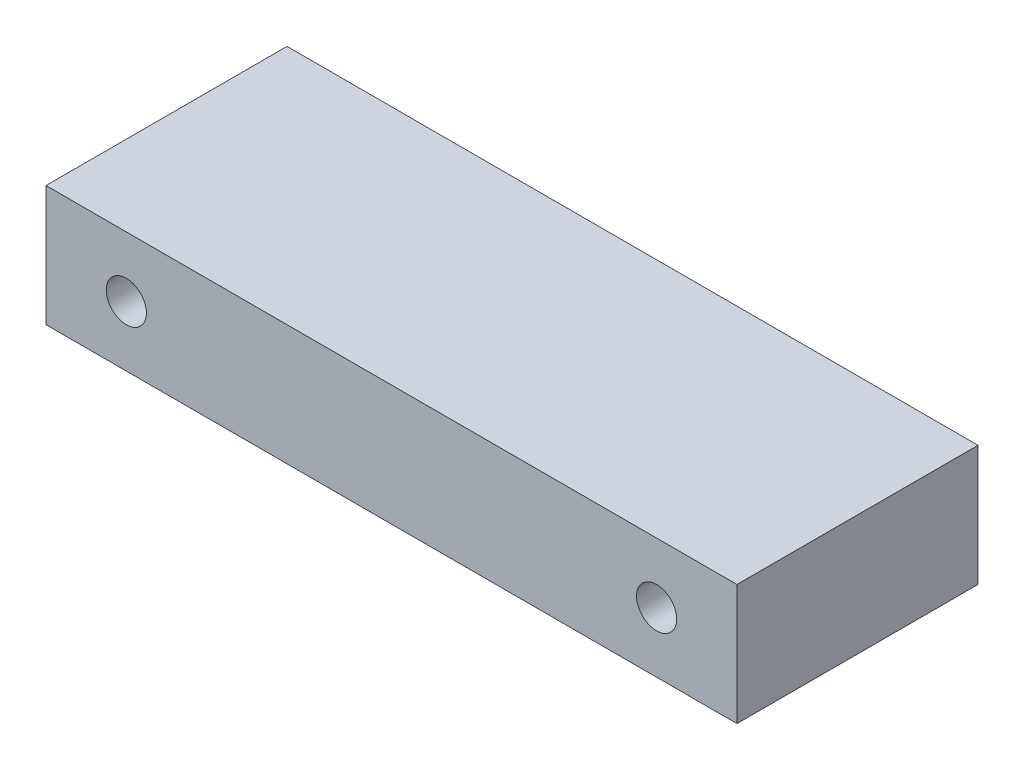
ISO-10303-21;
HEADER;
FILE_DESCRIPTION(('STEP AP214'),'2;1');
FILE_NAME('part.step','',(''),(''),'','','');
FILE_SCHEMA(('AUTOMOTIVE_DESIGN { 1 0 10303 214 1 1 1 1 }'));
ENDSEC;
DATA;
#1=APPLICATION_CONTEXT('core data for automotive mechanical design processes');
#2=APPLICATION_PROTOCOL_DEFINITION('international standard','automotive_design',2000,#1);
#3=PRODUCT_CONTEXT('',#1,'mechanical');
#4=PRODUCT('Part','Part','',(#3));
#5=PRODUCT_RELATED_PRODUCT_CATEGORY('part','',(#4));
#6=PRODUCT_DEFINITION_FORMATION('','',#4);
#7=PRODUCT_DEFINITION_CONTEXT('part definition',#1,'design');
#8=PRODUCT_DEFINITION('design','',#6,#7);
#9=PRODUCT_DEFINITION_SHAPE('','',#8);
#10=(LENGTH_UNIT() NAMED_UNIT(*) SI_UNIT(.MILLI.,.METRE.));
#11=(NAMED_UNIT(*) PLANE_ANGLE_UNIT() SI_UNIT($,.RADIAN.));
#12=(NAMED_UNIT(*) SI_UNIT($,.STERADIAN.) SOLID_ANGLE_UNIT());
#13=UNCERTAINTY_MEASURE_WITH_UNIT(LENGTH_MEASURE(1.E-05),#10,'distance_accuracy_value','');
#14=(GEOMETRIC_REPRESENTATION_CONTEXT(3) GLOBAL_UNCERTAINTY_ASSIGNED_CONTEXT((#13)) GLOBAL_UNIT_ASSIGNED_CONTEXT((#10,
#11,#12)) REPRESENTATION_CONTEXT('',''));
#15=CARTESIAN_POINT('',(0.,0.,0.));
#16=DIRECTION('',(0.,0.,1.));
#17=DIRECTION('',(1.,0.,0.));
#18=AXIS2_PLACEMENT_3D('',#15,#16,#17);
#19=CARTESIAN_POINT('',(0.,0.,38.1));
#20=DIRECTION('',(0.,1.,0.));
#21=DIRECTION('',(0.,0.,1.));
#22=AXIS2_PLACEMENT_3D('',#19,#20,#21);
#23=PLANE('',#22);
#24=DIRECTION('',(1.,0.,0.));
#25=VECTOR('',#24,1.);
#26=CARTESIAN_POINT('',(0.,0.,0.));
#27=LINE('',#26,#25);
#28=CARTESIAN_POINT('',(0.,0.,0.));
#29=VERTEX_POINT('',#28);
#30=CARTESIAN_POINT('',(109.22,0.,0.));
#31=VERTEX_POINT('',#30);
#32=EDGE_CURVE('E107',#29,#31,#27,.T.);
#33=ORIENTED_EDGE('',*,*,#32,.T.);
#34=DIRECTION('',(0.,0.,-1.));
#35=VECTOR('',#34,1.);
#36=CARTESIAN_POINT('',(109.22,0.,38.1));
#37=LINE('',#36,#35);
#38=CARTESIAN_POINT('',(109.22,0.,38.1));
#39=VERTEX_POINT('',#38);
#40=EDGE_CURVE('E11',#39,#31,#37,.T.);
#41=ORIENTED_EDGE('',*,*,#40,.F.);
#42=DIRECTION('',(1.,0.,0.));
#43=VECTOR('',#42,1.);
#44=CARTESIAN_POINT('',(0.,0.,38.1));
#45=LINE('',#44,#43);
#46=CARTESIAN_POINT('',(0.,0.,38.1));
#47=VERTEX_POINT('',#46);
#48=EDGE_CURVE('E89',#47,#39,#45,.T.);
#49=ORIENTED_EDGE('',*,*,#48,.F.);
#50=DIRECTION('',(0.,0.,-1.));
#51=VECTOR('',#50,1.);
#52=CARTESIAN_POINT('',(0.,0.,38.1));
#53=LINE('',#52,#51);
#54=EDGE_CURVE('E97',#47,#29,#53,.T.);
#55=ORIENTED_EDGE('',*,*,#54,.T.);
#56=EDGE_LOOP('',(#33,#41,#49,#55));
#57=FACE_BOUND('',#56,.T.);
#58=ADVANCED_FACE('F37',(#57),#23,.F.);
#59=CARTESIAN_POINT('',(109.22,0.,38.1));
#60=DIRECTION('',(-1.,0.,0.));
#61=DIRECTION('',(0.,0.,1.));
#62=AXIS2_PLACEMENT_3D('',#59,#60,#61);
#63=PLANE('',#62);
#64=DIRECTION('',(0.,1.,0.));
#65=VECTOR('',#64,1.);
#66=CARTESIAN_POINT('',(109.22,0.,0.));
#67=LINE('',#66,#65);
#68=CARTESIAN_POINT('',(109.22,19.05,0.));
#69=VERTEX_POINT('',#68);
#70=EDGE_CURVE('E93',#31,#69,#67,.T.);
#71=ORIENTED_EDGE('',*,*,#70,.T.);
#72=DIRECTION('',(0.,0.,-1.));
#73=VECTOR('',#72,1.);
#74=CARTESIAN_POINT('',(109.22,19.05,38.1));
#75=LINE('',#74,#73);
#76=CARTESIAN_POINT('',(109.22,19.05,38.1));
#77=VERTEX_POINT('',#76);
#78=EDGE_CURVE('E46',#77,#69,#75,.T.);
#79=ORIENTED_EDGE('',*,*,#78,.F.);
#80=DIRECTION('',(0.,1.,0.));
#81=VECTOR('',#80,1.);
#82=CARTESIAN_POINT('',(109.22,0.,38.1));
#83=LINE('',#82,#81);
#84=EDGE_CURVE('E84',#39,#77,#83,.T.);
#85=ORIENTED_EDGE('',*,*,#84,.F.);
#86=ORIENTED_EDGE('',*,*,#40,.T.);
#87=EDGE_LOOP('',(#71,#79,#85,#86));
#88=FACE_BOUND('',#87,.T.);
#89=ADVANCED_FACE('F92',(#88),#63,.F.);
#90=CARTESIAN_POINT('',(0.,19.05,38.1));
#91=DIRECTION('',(0.,-1.,0.));
#92=DIRECTION('',(0.,0.,-1.));
#93=AXIS2_PLACEMENT_3D('',#90,#91,#92);
#94=PLANE('',#93);
#95=DIRECTION('',(-1.,0.,0.));
#96=VECTOR('',#95,1.);
#97=CARTESIAN_POINT('',(0.,19.05,0.));
#98=LINE('',#97,#96);
#99=CARTESIAN_POINT('',(0.,19.05,0.));
#100=VERTEX_POINT('',#99);
#101=EDGE_CURVE('E71',#69,#100,#98,.T.);
#102=ORIENTED_EDGE('',*,*,#101,.T.);
#103=DIRECTION('',(0.,0.,-1.));
#104=VECTOR('',#103,1.);
#105=CARTESIAN_POINT('',(0.,19.05,38.1));
#106=LINE('',#105,#104);
#107=CARTESIAN_POINT('',(0.,19.05,38.1));
#108=VERTEX_POINT('',#107);
#109=EDGE_CURVE('E94',#108,#100,#106,.T.);
#110=ORIENTED_EDGE('',*,*,#109,.F.);
#111=DIRECTION('',(-1.,0.,0.));
#112=VECTOR('',#111,1.);
#113=CARTESIAN_POINT('',(0.,19.05,38.1));
#114=LINE('',#113,#112);
#115=EDGE_CURVE('E87',#77,#108,#114,.T.);
#116=ORIENTED_EDGE('',*,*,#115,.F.);
#117=ORIENTED_EDGE('',*,*,#78,.T.);
#118=EDGE_LOOP('',(#102,#110,#116,#117));
#119=FACE_BOUND('',#118,.T.);
#120=ADVANCED_FACE('F95',(#119),#94,.F.);
#121=CARTESIAN_POINT('',(12.7,9.52499999999997,38.1));
#122=DIRECTION('',(0.,0.,-1.));
#123=DIRECTION('',(-1.,0.,0.));
#124=AXIS2_PLACEMENT_3D('',#121,#122,#123);
#125=CYLINDRICAL_SURFACE('',#124,3.175);
#126=CARTESIAN_POINT('',(12.7,9.52499999999997,38.1));
#127=DIRECTION('',(0.,0.,1.));
#128=DIRECTION('',(1.,0.,0.));
#129=AXIS2_PLACEMENT_3D('',#126,#127,#128);
#130=CIRCLE('',#129,3.175);
#131=CARTESIAN_POINT('',(15.875,9.52499999999997,38.1));
#132=VERTEX_POINT('',#131);
#133=EDGE_CURVE('E120',#132,#132,#130,.T.);
#134=ORIENTED_EDGE('',*,*,#133,.T.);
#135=EDGE_LOOP('',(#134));
#136=FACE_BOUND('',#135,.T.);
#137=CARTESIAN_POINT('',(12.7,9.52499999999997,0.));
#138=DIRECTION('',(0.,0.,1.));
#139=DIRECTION('',(1.,0.,0.));
#140=AXIS2_PLACEMENT_3D('',#137,#138,#139);
#141=CIRCLE('',#140,3.175);
#142=CARTESIAN_POINT('',(15.875,9.52499999999997,0.));
#143=VERTEX_POINT('',#142);
#144=EDGE_CURVE('E104',#143,#143,#141,.T.);
#145=ORIENTED_EDGE('',*,*,#144,.F.);
#146=EDGE_LOOP('',(#145));
#147=FACE_BOUND('',#146,.T.);
#148=ADVANCED_FACE('F134',(#136,#147),#125,.F.);
#149=CARTESIAN_POINT('',(96.52,9.52499999999997,38.1));
#150=DIRECTION('',(0.,0.,-1.));
#151=DIRECTION('',(-1.,0.,0.));
#152=AXIS2_PLACEMENT_3D('',#149,#150,#151);
#153=CYLINDRICAL_SURFACE('',#152,3.175);
#154=CARTESIAN_POINT('',(96.52,9.52499999999997,38.1));
#155=DIRECTION('',(0.,0.,1.));
#156=DIRECTION('',(1.,0.,0.));
#157=AXIS2_PLACEMENT_3D('',#154,#155,#156);
#158=CIRCLE('',#157,3.175);
#159=CARTESIAN_POINT('',(99.695,9.52499999999997,38.1));
#160=VERTEX_POINT('',#159);
#161=EDGE_CURVE('E113',#160,#160,#158,.T.);
#162=ORIENTED_EDGE('',*,*,#161,.T.);
#163=EDGE_LOOP('',(#162));
#164=FACE_BOUND('',#163,.T.);
#165=CARTESIAN_POINT('',(96.52,9.52499999999997,0.));
#166=DIRECTION('',(0.,0.,1.));
#167=DIRECTION('',(1.,0.,0.));
#168=AXIS2_PLACEMENT_3D('',#165,#166,#167);
#169=CIRCLE('',#168,3.175);
#170=CARTESIAN_POINT('',(99.695,9.52499999999997,0.));
#171=VERTEX_POINT('',#170);
#172=EDGE_CURVE('E101',#171,#171,#169,.T.);
#173=ORIENTED_EDGE('',*,*,#172,.F.);
#174=EDGE_LOOP('',(#173));
#175=FACE_BOUND('',#174,.T.);
#176=ADVANCED_FACE('F39',(#164,#175),#153,.F.);
#177=CARTESIAN_POINT('',(0.,0.,38.1));
#178=DIRECTION('',(1.,0.,0.));
#179=DIRECTION('',(0.,0.,-1.));
#180=AXIS2_PLACEMENT_3D('',#177,#178,#179);
#181=PLANE('',#180);
#182=DIRECTION('',(0.,-1.,0.));
#183=VECTOR('',#182,1.);
#184=CARTESIAN_POINT('',(0.,0.,0.));
#185=LINE('',#184,#183);
#186=EDGE_CURVE('E77',#100,#29,#185,.T.);
#187=ORIENTED_EDGE('',*,*,#186,.T.);
#188=ORIENTED_EDGE('',*,*,#54,.F.);
#189=DIRECTION('',(0.,-1.,0.));
#190=VECTOR('',#189,1.);
#191=CARTESIAN_POINT('',(0.,0.,38.1));
#192=LINE('',#191,#190);
#193=EDGE_CURVE('E54',#108,#47,#192,.T.);
#194=ORIENTED_EDGE('',*,*,#193,.F.);
#195=ORIENTED_EDGE('',*,*,#109,.T.);
#196=EDGE_LOOP('',(#187,#188,#194,#195));
#197=FACE_BOUND('',#196,.T.);
#198=ADVANCED_FACE('F115',(#197),#181,.F.);
#199=CARTESIAN_POINT('',(0.,0.,38.1));
#200=DIRECTION('',(0.,0.,1.));
#201=DIRECTION('',(1.,0.,0.));
#202=AXIS2_PLACEMENT_3D('',#199,#200,#201);
#203=PLANE('',#202);
#204=ORIENTED_EDGE('',*,*,#161,.F.);
#205=EDGE_LOOP('',(#204));
#206=FACE_BOUND('',#205,.T.);
#207=ORIENTED_EDGE('',*,*,#133,.F.);
#208=EDGE_LOOP('',(#207));
#209=FACE_BOUND('',#208,.T.);
#210=ORIENTED_EDGE('',*,*,#48,.T.);
#211=ORIENTED_EDGE('',*,*,#84,.T.);
#212=ORIENTED_EDGE('',*,*,#115,.T.);
#213=ORIENTED_EDGE('',*,*,#193,.T.);
#214=EDGE_LOOP('',(#210,#211,#212,#213));
#215=FACE_BOUND('',#214,.T.);
#216=ADVANCED_FACE('F85',(#206,#209,#215),#203,.T.);
#217=CARTESIAN_POINT('',(0.,0.,0.));
#218=DIRECTION('',(0.,0.,1.));
#219=DIRECTION('',(1.,0.,0.));
#220=AXIS2_PLACEMENT_3D('',#217,#218,#219);
#221=PLANE('',#220);
#222=ORIENTED_EDGE('',*,*,#172,.T.);
#223=EDGE_LOOP('',(#222));
#224=FACE_BOUND('',#223,.T.);
#225=ORIENTED_EDGE('',*,*,#144,.T.);
#226=EDGE_LOOP('',(#225));
#227=FACE_BOUND('',#226,.T.);
#228=ORIENTED_EDGE('',*,*,#32,.F.);
#229=ORIENTED_EDGE('',*,*,#186,.F.);
#230=ORIENTED_EDGE('',*,*,#101,.F.);
#231=ORIENTED_EDGE('',*,*,#70,.F.);
#232=EDGE_LOOP('',(#228,#229,#230,#231));
#233=FACE_BOUND('',#232,.T.);
#234=ADVANCED_FACE('F118',(#224,#227,#233),#221,.F.);
#235=CLOSED_SHELL('',(#58,#89,#120,#148,#176,#198,#216,#234));
#236=MANIFOLD_SOLID_BREP('B2',#235);
#237=ADVANCED_BREP_SHAPE_REPRESENTATION('',(#18,#236),#14);
#238=SHAPE_DEFINITION_REPRESENTATION(#9,#237);
ENDSEC;
END-ISO-10303-21;
